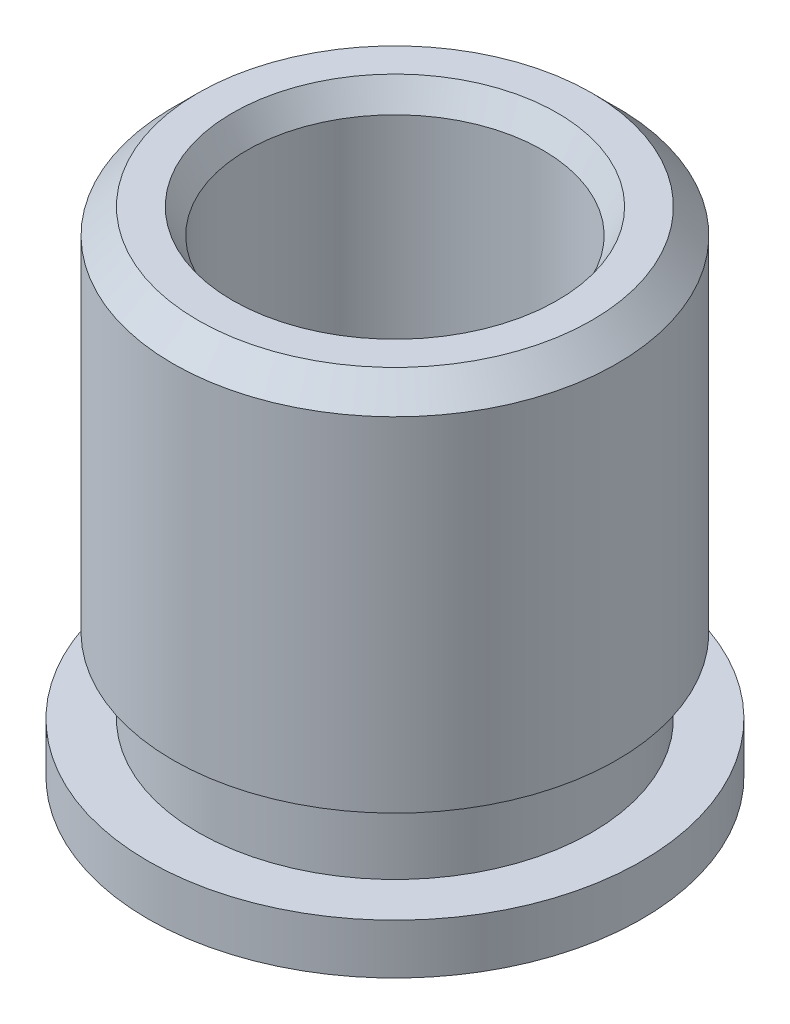
ISO-10303-21;
HEADER;
FILE_DESCRIPTION(('STEP AP214'),'2;1');
FILE_NAME('part.step','',(''),(''),'','','');
FILE_SCHEMA(('AUTOMOTIVE_DESIGN { 1 0 10303 214 1 1 1 1 }'));
ENDSEC;
DATA;
#1=APPLICATION_CONTEXT('core data for automotive mechanical design processes');
#2=APPLICATION_PROTOCOL_DEFINITION('international standard','automotive_design',2000,#1);
#3=PRODUCT_CONTEXT('',#1,'mechanical');
#4=PRODUCT('Part','Part','',(#3));
#5=PRODUCT_RELATED_PRODUCT_CATEGORY('part','',(#4));
#6=PRODUCT_DEFINITION_FORMATION('','',#4);
#7=PRODUCT_DEFINITION_CONTEXT('part definition',#1,'design');
#8=PRODUCT_DEFINITION('design','',#6,#7);
#9=PRODUCT_DEFINITION_SHAPE('','',#8);
#10=(LENGTH_UNIT() NAMED_UNIT(*) SI_UNIT(.MILLI.,.METRE.));
#11=(NAMED_UNIT(*) PLANE_ANGLE_UNIT() SI_UNIT($,.RADIAN.));
#12=(NAMED_UNIT(*) SI_UNIT($,.STERADIAN.) SOLID_ANGLE_UNIT());
#13=UNCERTAINTY_MEASURE_WITH_UNIT(LENGTH_MEASURE(1.E-05),#10,'distance_accuracy_value','');
#14=(GEOMETRIC_REPRESENTATION_CONTEXT(3) GLOBAL_UNCERTAINTY_ASSIGNED_CONTEXT((#13)) GLOBAL_UNIT_ASSIGNED_CONTEXT((#10,
#11,#12)) REPRESENTATION_CONTEXT('',''));
#15=CARTESIAN_POINT('',(0.,0.,0.));
#16=DIRECTION('',(0.,0.,1.));
#17=DIRECTION('',(1.,0.,0.));
#18=AXIS2_PLACEMENT_3D('',#15,#16,#17);
#19=CARTESIAN_POINT('',(0.,2.5019,0.));
#20=DIRECTION('',(0.,1.,0.));
#21=DIRECTION('',(0.,0.,1.));
#22=AXIS2_PLACEMENT_3D('',#19,#20,#21);
#23=CYLINDRICAL_SURFACE('',#22,2.5019);
#24=CARTESIAN_POINT('',(0.,-2.5019,0.));
#25=DIRECTION('',(0.,1.,0.));
#26=DIRECTION('',(0.,0.,1.));
#27=AXIS2_PLACEMENT_3D('',#24,#25,#26);
#28=CIRCLE('',#27,2.5019);
#29=CARTESIAN_POINT('',(0.,-2.5019,2.5019));
#30=VERTEX_POINT('',#29);
#31=EDGE_CURVE('E51',#30,#30,#28,.T.);
#32=ORIENTED_EDGE('',*,*,#31,.T.);
#33=EDGE_LOOP('',(#32));
#34=FACE_BOUND('',#33,.T.);
#35=CARTESIAN_POINT('',(0.,-1.9939,0.));
#36=DIRECTION('',(0.,1.,0.));
#37=DIRECTION('',(0.,0.,1.));
#38=AXIS2_PLACEMENT_3D('',#35,#36,#37);
#39=CIRCLE('',#38,2.5019);
#40=CARTESIAN_POINT('',(0.,-1.9939,2.5019));
#41=VERTEX_POINT('',#40);
#42=EDGE_CURVE('E10',#41,#41,#39,.T.);
#43=ORIENTED_EDGE('',*,*,#42,.F.);
#44=EDGE_LOOP('',(#43));
#45=FACE_BOUND('',#44,.T.);
#46=ADVANCED_FACE('F14',(#34,#45),#23,.T.);
#47=CARTESIAN_POINT('',(1.25095,-1.9939,0.));
#48=DIRECTION('',(0.,1.,0.));
#49=DIRECTION('',(0.,0.,1.));
#50=AXIS2_PLACEMENT_3D('',#47,#48,#49);
#51=PLANE('',#50);
#52=ORIENTED_EDGE('',*,*,#42,.T.);
#53=EDGE_LOOP('',(#52));
#54=FACE_BOUND('',#53,.T.);
#55=CARTESIAN_POINT('',(0.,-1.9939,0.));
#56=DIRECTION('',(0.,1.,0.));
#57=DIRECTION('',(0.,0.,1.));
#58=AXIS2_PLACEMENT_3D('',#55,#56,#57);
#59=CIRCLE('',#58,1.99644);
#60=CARTESIAN_POINT('',(0.,-1.9939,1.99644));
#61=VERTEX_POINT('',#60);
#62=EDGE_CURVE('E20',#61,#61,#59,.T.);
#63=ORIENTED_EDGE('',*,*,#62,.F.);
#64=EDGE_LOOP('',(#63));
#65=FACE_BOUND('',#64,.T.);
#66=ADVANCED_FACE('F76',(#54,#65),#51,.T.);
#67=CARTESIAN_POINT('',(0.,2.5019,0.));
#68=DIRECTION('',(0.,1.,0.));
#69=DIRECTION('',(0.,0.,1.));
#70=AXIS2_PLACEMENT_3D('',#67,#68,#69);
#71=CYLINDRICAL_SURFACE('',#70,1.99644);
#72=ORIENTED_EDGE('',*,*,#62,.T.);
#73=EDGE_LOOP('',(#72));
#74=FACE_BOUND('',#73,.T.);
#75=CARTESIAN_POINT('',(0.,-1.2319,0.));
#76=DIRECTION('',(0.,1.,0.));
#77=DIRECTION('',(0.,0.,1.));
#78=AXIS2_PLACEMENT_3D('',#75,#76,#77);
#79=CIRCLE('',#78,1.99644);
#80=CARTESIAN_POINT('',(0.,-1.2319,1.99644));
#81=VERTEX_POINT('',#80);
#82=EDGE_CURVE('E24',#81,#81,#79,.T.);
#83=ORIENTED_EDGE('',*,*,#82,.F.);
#84=EDGE_LOOP('',(#83));
#85=FACE_BOUND('',#84,.T.);
#86=ADVANCED_FACE('F80',(#74,#85),#71,.T.);
#87=CARTESIAN_POINT('',(1.25095,-1.2319,0.));
#88=DIRECTION('',(0.,-1.,0.));
#89=DIRECTION('',(0.,0.,-1.));
#90=AXIS2_PLACEMENT_3D('',#87,#88,#89);
#91=PLANE('',#90);
#92=ORIENTED_EDGE('',*,*,#82,.T.);
#93=EDGE_LOOP('',(#92));
#94=FACE_BOUND('',#93,.T.);
#95=CARTESIAN_POINT('',(0.,-1.2319,0.));
#96=DIRECTION('',(0.,1.,0.));
#97=DIRECTION('',(0.,0.,1.));
#98=AXIS2_PLACEMENT_3D('',#95,#96,#97);
#99=CIRCLE('',#98,2.25044);
#100=CARTESIAN_POINT('',(0.,-1.2319,2.25044));
#101=VERTEX_POINT('',#100);
#102=EDGE_CURVE('E28',#101,#101,#99,.T.);
#103=ORIENTED_EDGE('',*,*,#102,.F.);
#104=EDGE_LOOP('',(#103));
#105=FACE_BOUND('',#104,.T.);
#106=ADVANCED_FACE('F84',(#94,#105),#91,.T.);
#107=CARTESIAN_POINT('',(0.,2.5019,0.));
#108=DIRECTION('',(0.,1.,0.));
#109=DIRECTION('',(0.,0.,1.));
#110=AXIS2_PLACEMENT_3D('',#107,#108,#109);
#111=CYLINDRICAL_SURFACE('',#110,2.25044);
#112=ORIENTED_EDGE('',*,*,#102,.T.);
#113=EDGE_LOOP('',(#112));
#114=FACE_BOUND('',#113,.T.);
#115=CARTESIAN_POINT('',(0.,2.2479,0.));
#116=DIRECTION('',(0.,1.,0.));
#117=DIRECTION('',(0.,0.,1.));
#118=AXIS2_PLACEMENT_3D('',#115,#116,#117);
#119=CIRCLE('',#118,2.25044);
#120=CARTESIAN_POINT('',(0.,2.2479,2.25044));
#121=VERTEX_POINT('',#120);
#122=EDGE_CURVE('E33',#121,#121,#119,.T.);
#123=ORIENTED_EDGE('',*,*,#122,.F.);
#124=EDGE_LOOP('',(#123));
#125=FACE_BOUND('',#124,.T.);
#126=ADVANCED_FACE('F90',(#114,#125),#111,.T.);
#127=CARTESIAN_POINT('',(0.,2.5019,0.));
#128=DIRECTION('',(0.,-1.,0.));
#129=DIRECTION('',(0.,0.,-1.));
#130=AXIS2_PLACEMENT_3D('',#127,#128,#129);
#131=CONICAL_SURFACE('',#130,1.99644,0.785398163397448);
#132=ORIENTED_EDGE('',*,*,#122,.T.);
#133=EDGE_LOOP('',(#132));
#134=FACE_BOUND('',#133,.T.);
#135=CARTESIAN_POINT('',(0.,2.5019,0.));
#136=DIRECTION('',(0.,1.,0.));
#137=DIRECTION('',(0.,0.,1.));
#138=AXIS2_PLACEMENT_3D('',#135,#136,#137);
#139=CIRCLE('',#138,1.99644);
#140=CARTESIAN_POINT('',(0.,2.5019,1.99644));
#141=VERTEX_POINT('',#140);
#142=EDGE_CURVE('E36',#141,#141,#139,.T.);
#143=ORIENTED_EDGE('',*,*,#142,.F.);
#144=EDGE_LOOP('',(#143));
#145=FACE_BOUND('',#144,.T.);
#146=ADVANCED_FACE('F94',(#134,#145),#131,.T.);
#147=CARTESIAN_POINT('',(1.25095,2.5019,0.));
#148=DIRECTION('',(0.,1.,0.));
#149=DIRECTION('',(0.,0.,1.));
#150=AXIS2_PLACEMENT_3D('',#147,#148,#149);
#151=PLANE('',#150);
#152=ORIENTED_EDGE('',*,*,#142,.T.);
#153=EDGE_LOOP('',(#152));
#154=FACE_BOUND('',#153,.T.);
#155=CARTESIAN_POINT('',(0.,2.5019,0.));
#156=DIRECTION('',(0.,1.,0.));
#157=DIRECTION('',(0.,0.,1.));
#158=AXIS2_PLACEMENT_3D('',#155,#156,#157);
#159=CIRCLE('',#158,1.64664696837417);
#160=CARTESIAN_POINT('',(0.,2.5019,1.64664696837417));
#161=VERTEX_POINT('',#160);
#162=EDGE_CURVE('E39',#161,#161,#159,.T.);
#163=ORIENTED_EDGE('',*,*,#162,.F.);
#164=EDGE_LOOP('',(#163));
#165=FACE_BOUND('',#164,.T.);
#166=ADVANCED_FACE('F98',(#154,#165),#151,.T.);
#167=CARTESIAN_POINT('',(0.,2.2479,0.));
#168=DIRECTION('',(0.,1.,0.));
#169=DIRECTION('',(0.,0.,1.));
#170=AXIS2_PLACEMENT_3D('',#167,#168,#169);
#171=CONICAL_SURFACE('',#170,1.5,0.523598775598301);
#172=ORIENTED_EDGE('',*,*,#162,.T.);
#173=EDGE_LOOP('',(#172));
#174=FACE_BOUND('',#173,.T.);
#175=CARTESIAN_POINT('',(0.,2.2479,0.));
#176=DIRECTION('',(0.,1.,0.));
#177=DIRECTION('',(0.,0.,1.));
#178=AXIS2_PLACEMENT_3D('',#175,#176,#177);
#179=CIRCLE('',#178,1.5);
#180=CARTESIAN_POINT('',(0.,2.2479,1.5));
#181=VERTEX_POINT('',#180);
#182=EDGE_CURVE('E42',#181,#181,#179,.T.);
#183=ORIENTED_EDGE('',*,*,#182,.F.);
#184=EDGE_LOOP('',(#183));
#185=FACE_BOUND('',#184,.T.);
#186=ADVANCED_FACE('F72',(#174,#185),#171,.F.);
#187=CARTESIAN_POINT('',(0.,2.5019,0.));
#188=DIRECTION('',(0.,1.,0.));
#189=DIRECTION('',(0.,0.,1.));
#190=AXIS2_PLACEMENT_3D('',#187,#188,#189);
#191=CYLINDRICAL_SURFACE('',#190,1.5);
#192=ORIENTED_EDGE('',*,*,#182,.T.);
#193=EDGE_LOOP('',(#192));
#194=FACE_BOUND('',#193,.T.);
#195=CARTESIAN_POINT('',(0.,-2.2479,0.));
#196=DIRECTION('',(0.,1.,0.));
#197=DIRECTION('',(0.,0.,1.));
#198=AXIS2_PLACEMENT_3D('',#195,#196,#197);
#199=CIRCLE('',#198,1.5);
#200=CARTESIAN_POINT('',(0.,-2.2479,1.5));
#201=VERTEX_POINT('',#200);
#202=EDGE_CURVE('E45',#201,#201,#199,.T.);
#203=ORIENTED_EDGE('',*,*,#202,.F.);
#204=EDGE_LOOP('',(#203));
#205=FACE_BOUND('',#204,.T.);
#206=ADVANCED_FACE('F65',(#194,#205),#191,.F.);
#207=CARTESIAN_POINT('',(0.,-2.5019,0.));
#208=DIRECTION('',(0.,-1.,0.));
#209=DIRECTION('',(0.,0.,-1.));
#210=AXIS2_PLACEMENT_3D('',#207,#208,#209);
#211=CONICAL_SURFACE('',#210,1.64664696837417,0.523598775598299);
#212=ORIENTED_EDGE('',*,*,#202,.T.);
#213=EDGE_LOOP('',(#212));
#214=FACE_BOUND('',#213,.T.);
#215=CARTESIAN_POINT('',(0.,-2.5019,0.));
#216=DIRECTION('',(0.,1.,0.));
#217=DIRECTION('',(0.,0.,1.));
#218=AXIS2_PLACEMENT_3D('',#215,#216,#217);
#219=CIRCLE('',#218,1.64664696837417);
#220=CARTESIAN_POINT('',(0.,-2.5019,1.64664696837417));
#221=VERTEX_POINT('',#220);
#222=EDGE_CURVE('E48',#221,#221,#219,.T.);
#223=ORIENTED_EDGE('',*,*,#222,.F.);
#224=EDGE_LOOP('',(#223));
#225=FACE_BOUND('',#224,.T.);
#226=ADVANCED_FACE('F60',(#214,#225),#211,.F.);
#227=CARTESIAN_POINT('',(1.25095,-2.5019,0.));
#228=DIRECTION('',(0.,1.,0.));
#229=DIRECTION('',(0.,0.,1.));
#230=AXIS2_PLACEMENT_3D('',#227,#228,#229);
#231=PLANE('',#230);
#232=ORIENTED_EDGE('',*,*,#31,.F.);
#233=EDGE_LOOP('',(#232));
#234=FACE_BOUND('',#233,.T.);
#235=ORIENTED_EDGE('',*,*,#222,.T.);
#236=EDGE_LOOP('',(#235));
#237=FACE_BOUND('',#236,.T.);
#238=ADVANCED_FACE('F57',(#234,#237),#231,.F.);
#239=CLOSED_SHELL('',(#46,#66,#86,#106,#126,#146,#166,#186,#206,#226,#238));
#240=MANIFOLD_SOLID_BREP('B1',#239);
#241=ADVANCED_BREP_SHAPE_REPRESENTATION('',(#18,#240),#14);
#242=SHAPE_DEFINITION_REPRESENTATION(#9,#241);
ENDSEC;
END-ISO-10303-21;
